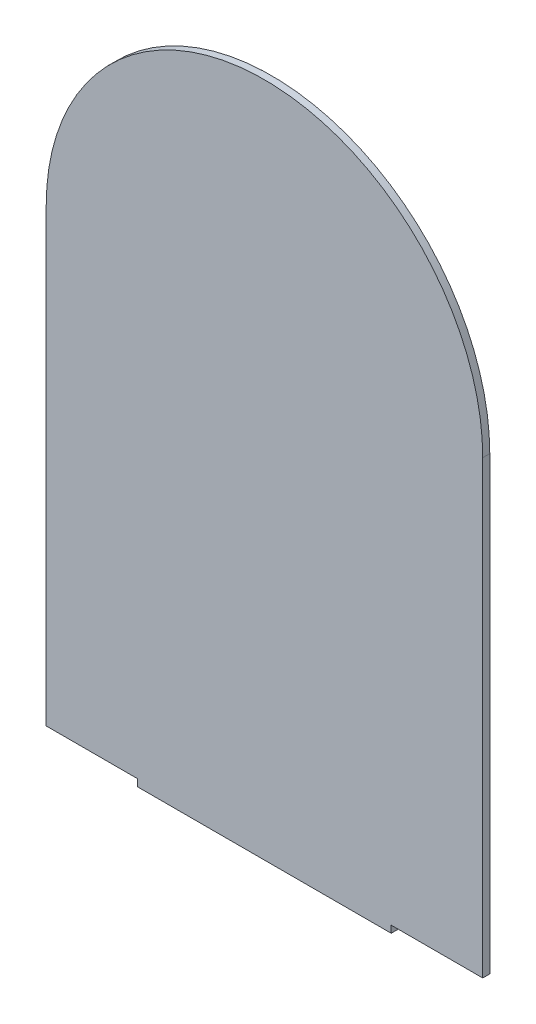
ISO-10303-21;
HEADER;
FILE_DESCRIPTION(('STEP AP214'),'2;1');
FILE_NAME('part.step','',(''),(''),'','','');
FILE_SCHEMA(('AUTOMOTIVE_DESIGN { 1 0 10303 214 1 1 1 1 }'));
ENDSEC;
DATA;
#1=APPLICATION_CONTEXT('core data for automotive mechanical design processes');
#2=APPLICATION_PROTOCOL_DEFINITION('international standard','automotive_design',2000,#1);
#3=PRODUCT_CONTEXT('',#1,'mechanical');
#4=PRODUCT('Part','Part','',(#3));
#5=PRODUCT_RELATED_PRODUCT_CATEGORY('part','',(#4));
#6=PRODUCT_DEFINITION_FORMATION('','',#4);
#7=PRODUCT_DEFINITION_CONTEXT('part definition',#1,'design');
#8=PRODUCT_DEFINITION('design','',#6,#7);
#9=PRODUCT_DEFINITION_SHAPE('','',#8);
#10=(LENGTH_UNIT() NAMED_UNIT(*) SI_UNIT(.MILLI.,.METRE.));
#11=(NAMED_UNIT(*) PLANE_ANGLE_UNIT() SI_UNIT($,.RADIAN.));
#12=(NAMED_UNIT(*) SI_UNIT($,.STERADIAN.) SOLID_ANGLE_UNIT());
#13=UNCERTAINTY_MEASURE_WITH_UNIT(LENGTH_MEASURE(1.E-05),#10,'distance_accuracy_value','');
#14=(GEOMETRIC_REPRESENTATION_CONTEXT(3) GLOBAL_UNCERTAINTY_ASSIGNED_CONTEXT((#13)) GLOBAL_UNIT_ASSIGNED_CONTEXT((#10,
#11,#12)) REPRESENTATION_CONTEXT('',''));
#15=CARTESIAN_POINT('',(0.,0.,0.));
#16=DIRECTION('',(0.,0.,1.));
#17=DIRECTION('',(1.,0.,0.));
#18=AXIS2_PLACEMENT_3D('',#15,#16,#17);
#19=CARTESIAN_POINT('',(98.425,203.2,3.175));
#20=DIRECTION('',(0.,0.,-1.));
#21=DIRECTION('',(-1.,0.,0.));
#22=AXIS2_PLACEMENT_3D('',#19,#20,#21);
#23=CYLINDRICAL_SURFACE('',#22,98.425);
#24=CARTESIAN_POINT('',(98.425,203.2,0.));
#25=DIRECTION('',(0.,0.,1.));
#26=DIRECTION('',(-1.,0.,0.));
#27=AXIS2_PLACEMENT_3D('',#24,#25,#26);
#28=CIRCLE('',#27,98.425);
#29=CARTESIAN_POINT('',(196.85,203.2,0.));
#30=VERTEX_POINT('',#29);
#31=CARTESIAN_POINT('',(0.,203.2,0.));
#32=VERTEX_POINT('',#31);
#33=EDGE_CURVE('E131',#30,#32,#28,.T.);
#34=ORIENTED_EDGE('',*,*,#33,.T.);
#35=DIRECTION('',(0.,0.,-1.));
#36=VECTOR('',#35,1.);
#37=CARTESIAN_POINT('',(0.,203.2,3.175));
#38=LINE('',#37,#36);
#39=CARTESIAN_POINT('',(0.,203.2,3.175));
#40=VERTEX_POINT('',#39);
#41=EDGE_CURVE('E11',#40,#32,#38,.T.);
#42=ORIENTED_EDGE('',*,*,#41,.F.);
#43=CARTESIAN_POINT('',(98.425,203.2,3.175));
#44=DIRECTION('',(0.,0.,1.));
#45=DIRECTION('',(-1.,0.,0.));
#46=AXIS2_PLACEMENT_3D('',#43,#44,#45);
#47=CIRCLE('',#46,98.425);
#48=CARTESIAN_POINT('',(196.85,203.2,3.175));
#49=VERTEX_POINT('',#48);
#50=EDGE_CURVE('E145',#49,#40,#47,.T.);
#51=ORIENTED_EDGE('',*,*,#50,.F.);
#52=DIRECTION('',(0.,0.,-1.));
#53=VECTOR('',#52,1.);
#54=CARTESIAN_POINT('',(196.85,203.2,3.175));
#55=LINE('',#54,#53);
#56=EDGE_CURVE('E127',#49,#30,#55,.T.);
#57=ORIENTED_EDGE('',*,*,#56,.T.);
#58=EDGE_LOOP('',(#34,#42,#51,#57));
#59=FACE_BOUND('',#58,.T.);
#60=ADVANCED_FACE('F35',(#59),#23,.T.);
#61=CARTESIAN_POINT('',(0.,203.2,3.175));
#62=DIRECTION('',(1.,0.,0.));
#63=DIRECTION('',(0.,1.,0.));
#64=AXIS2_PLACEMENT_3D('',#61,#62,#63);
#65=PLANE('',#64);
#66=DIRECTION('',(0.,-1.,0.));
#67=VECTOR('',#66,1.);
#68=CARTESIAN_POINT('',(0.,203.2,0.));
#69=LINE('',#68,#67);
#70=CARTESIAN_POINT('',(0.,0.,0.));
#71=VERTEX_POINT('',#70);
#72=EDGE_CURVE('E134',#32,#71,#69,.T.);
#73=ORIENTED_EDGE('',*,*,#72,.T.);
#74=DIRECTION('',(0.,0.,-1.));
#75=VECTOR('',#74,1.);
#76=CARTESIAN_POINT('',(0.,0.,3.175));
#77=LINE('',#76,#75);
#78=CARTESIAN_POINT('',(0.,0.,3.175));
#79=VERTEX_POINT('',#78);
#80=EDGE_CURVE('E43',#79,#71,#77,.T.);
#81=ORIENTED_EDGE('',*,*,#80,.F.);
#82=DIRECTION('',(0.,-1.,0.));
#83=VECTOR('',#82,1.);
#84=CARTESIAN_POINT('',(0.,203.2,3.175));
#85=LINE('',#84,#83);
#86=EDGE_CURVE('E94',#40,#79,#85,.T.);
#87=ORIENTED_EDGE('',*,*,#86,.F.);
#88=ORIENTED_EDGE('',*,*,#41,.T.);
#89=EDGE_LOOP('',(#73,#81,#87,#88));
#90=FACE_BOUND('',#89,.T.);
#91=ADVANCED_FACE('F180',(#90),#65,.F.);
#92=CARTESIAN_POINT('',(0.,0.,3.175));
#93=DIRECTION('',(0.,1.,0.));
#94=DIRECTION('',(0.,0.,1.));
#95=AXIS2_PLACEMENT_3D('',#92,#93,#94);
#96=PLANE('',#95);
#97=DIRECTION('',(1.,0.,0.));
#98=VECTOR('',#97,1.);
#99=CARTESIAN_POINT('',(0.,0.,0.));
#100=LINE('',#99,#98);
#101=CARTESIAN_POINT('',(41.275,0.,0.));
#102=VERTEX_POINT('',#101);
#103=EDGE_CURVE('E136',#71,#102,#100,.T.);
#104=ORIENTED_EDGE('',*,*,#103,.T.);
#105=DIRECTION('',(0.,0.,-1.));
#106=VECTOR('',#105,1.);
#107=CARTESIAN_POINT('',(41.275,0.,3.175));
#108=LINE('',#107,#106);
#109=CARTESIAN_POINT('',(41.275,0.,3.175));
#110=VERTEX_POINT('',#109);
#111=EDGE_CURVE('E152',#110,#102,#108,.T.);
#112=ORIENTED_EDGE('',*,*,#111,.F.);
#113=DIRECTION('',(1.,0.,0.));
#114=VECTOR('',#113,1.);
#115=CARTESIAN_POINT('',(0.,0.,3.175));
#116=LINE('',#115,#114);
#117=EDGE_CURVE('E160',#79,#110,#116,.T.);
#118=ORIENTED_EDGE('',*,*,#117,.F.);
#119=ORIENTED_EDGE('',*,*,#80,.T.);
#120=EDGE_LOOP('',(#104,#112,#118,#119));
#121=FACE_BOUND('',#120,.T.);
#122=ADVANCED_FACE('F158',(#121),#96,.F.);
#123=CARTESIAN_POINT('',(41.275,0.,3.175));
#124=DIRECTION('',(1.,0.,0.));
#125=DIRECTION('',(0.,0.,-1.));
#126=AXIS2_PLACEMENT_3D('',#123,#124,#125);
#127=PLANE('',#126);
#128=DIRECTION('',(0.,-1.,0.));
#129=VECTOR('',#128,1.);
#130=CARTESIAN_POINT('',(41.275,0.,0.));
#131=LINE('',#130,#129);
#132=CARTESIAN_POINT('',(41.275,-3.175,0.));
#133=VERTEX_POINT('',#132);
#134=EDGE_CURVE('E138',#102,#133,#131,.T.);
#135=ORIENTED_EDGE('',*,*,#134,.T.);
#136=DIRECTION('',(0.,0.,-1.));
#137=VECTOR('',#136,1.);
#138=CARTESIAN_POINT('',(41.275,-3.175,3.175));
#139=LINE('',#138,#137);
#140=CARTESIAN_POINT('',(41.275,-3.175,3.175));
#141=VERTEX_POINT('',#140);
#142=EDGE_CURVE('E149',#141,#133,#139,.T.);
#143=ORIENTED_EDGE('',*,*,#142,.F.);
#144=DIRECTION('',(0.,-1.,0.));
#145=VECTOR('',#144,1.);
#146=CARTESIAN_POINT('',(41.275,0.,3.175));
#147=LINE('',#146,#145);
#148=EDGE_CURVE('E172',#110,#141,#147,.T.);
#149=ORIENTED_EDGE('',*,*,#148,.F.);
#150=ORIENTED_EDGE('',*,*,#111,.T.);
#151=EDGE_LOOP('',(#135,#143,#149,#150));
#152=FACE_BOUND('',#151,.T.);
#153=ADVANCED_FACE('F168',(#152),#127,.F.);
#154=CARTESIAN_POINT('',(41.275,-3.175,3.175));
#155=DIRECTION('',(0.,1.,0.));
#156=DIRECTION('',(0.,0.,1.));
#157=AXIS2_PLACEMENT_3D('',#154,#155,#156);
#158=PLANE('',#157);
#159=DIRECTION('',(1.,0.,0.));
#160=VECTOR('',#159,1.);
#161=CARTESIAN_POINT('',(41.275,-3.175,0.));
#162=LINE('',#161,#160);
#163=CARTESIAN_POINT('',(155.575,-3.175,0.));
#164=VERTEX_POINT('',#163);
#165=EDGE_CURVE('E140',#133,#164,#162,.T.);
#166=ORIENTED_EDGE('',*,*,#165,.T.);
#167=DIRECTION('',(0.,0.,-1.));
#168=VECTOR('',#167,1.);
#169=CARTESIAN_POINT('',(155.575,-3.175,3.175));
#170=LINE('',#169,#168);
#171=CARTESIAN_POINT('',(155.575,-3.175,3.175));
#172=VERTEX_POINT('',#171);
#173=EDGE_CURVE('E122',#172,#164,#170,.T.);
#174=ORIENTED_EDGE('',*,*,#173,.F.);
#175=DIRECTION('',(1.,0.,0.));
#176=VECTOR('',#175,1.);
#177=CARTESIAN_POINT('',(41.275,-3.175,3.175));
#178=LINE('',#177,#176);
#179=EDGE_CURVE('E113',#141,#172,#178,.T.);
#180=ORIENTED_EDGE('',*,*,#179,.F.);
#181=ORIENTED_EDGE('',*,*,#142,.T.);
#182=EDGE_LOOP('',(#166,#174,#180,#181));
#183=FACE_BOUND('',#182,.T.);
#184=ADVANCED_FACE('F171',(#183),#158,.F.);
#185=CARTESIAN_POINT('',(155.575,0.,3.175));
#186=DIRECTION('',(-1.,0.,0.));
#187=DIRECTION('',(0.,-1.,0.));
#188=AXIS2_PLACEMENT_3D('',#185,#186,#187);
#189=PLANE('',#188);
#190=DIRECTION('',(0.,1.,0.));
#191=VECTOR('',#190,1.);
#192=CARTESIAN_POINT('',(155.575,0.,0.));
#193=LINE('',#192,#191);
#194=CARTESIAN_POINT('',(155.575,0.,0.));
#195=VERTEX_POINT('',#194);
#196=EDGE_CURVE('E121',#164,#195,#193,.T.);
#197=ORIENTED_EDGE('',*,*,#196,.T.);
#198=DIRECTION('',(0.,0.,-1.));
#199=VECTOR('',#198,1.);
#200=CARTESIAN_POINT('',(155.575,0.,3.175));
#201=LINE('',#200,#199);
#202=CARTESIAN_POINT('',(155.575,0.,3.175));
#203=VERTEX_POINT('',#202);
#204=EDGE_CURVE('E118',#203,#195,#201,.T.);
#205=ORIENTED_EDGE('',*,*,#204,.F.);
#206=DIRECTION('',(0.,1.,0.));
#207=VECTOR('',#206,1.);
#208=CARTESIAN_POINT('',(155.575,0.,3.175));
#209=LINE('',#208,#207);
#210=EDGE_CURVE('E107',#172,#203,#209,.T.);
#211=ORIENTED_EDGE('',*,*,#210,.F.);
#212=ORIENTED_EDGE('',*,*,#173,.T.);
#213=EDGE_LOOP('',(#197,#205,#211,#212));
#214=FACE_BOUND('',#213,.T.);
#215=ADVANCED_FACE('F119',(#214),#189,.F.);
#216=CARTESIAN_POINT('',(155.575,0.,3.175));
#217=DIRECTION('',(0.,1.,0.));
#218=DIRECTION('',(0.,0.,1.));
#219=AXIS2_PLACEMENT_3D('',#216,#217,#218);
#220=PLANE('',#219);
#221=DIRECTION('',(1.,0.,0.));
#222=VECTOR('',#221,1.);
#223=CARTESIAN_POINT('',(155.575,0.,0.));
#224=LINE('',#223,#222);
#225=CARTESIAN_POINT('',(196.85,0.,0.));
#226=VERTEX_POINT('',#225);
#227=EDGE_CURVE('E80',#195,#226,#224,.T.);
#228=ORIENTED_EDGE('',*,*,#227,.T.);
#229=DIRECTION('',(0.,0.,-1.));
#230=VECTOR('',#229,1.);
#231=CARTESIAN_POINT('',(196.85,0.,3.175));
#232=LINE('',#231,#230);
#233=CARTESIAN_POINT('',(196.85,0.,3.175));
#234=VERTEX_POINT('',#233);
#235=EDGE_CURVE('E123',#234,#226,#232,.T.);
#236=ORIENTED_EDGE('',*,*,#235,.F.);
#237=DIRECTION('',(1.,0.,0.));
#238=VECTOR('',#237,1.);
#239=CARTESIAN_POINT('',(155.575,0.,3.175));
#240=LINE('',#239,#238);
#241=EDGE_CURVE('E111',#203,#234,#240,.T.);
#242=ORIENTED_EDGE('',*,*,#241,.F.);
#243=ORIENTED_EDGE('',*,*,#204,.T.);
#244=EDGE_LOOP('',(#228,#236,#242,#243));
#245=FACE_BOUND('',#244,.T.);
#246=ADVANCED_FACE('F125',(#245),#220,.F.);
#247=CARTESIAN_POINT('',(196.85,0.,3.175));
#248=DIRECTION('',(-1.,0.,0.));
#249=DIRECTION('',(0.,-1.,0.));
#250=AXIS2_PLACEMENT_3D('',#247,#248,#249);
#251=PLANE('',#250);
#252=DIRECTION('',(0.,1.,0.));
#253=VECTOR('',#252,1.);
#254=CARTESIAN_POINT('',(196.85,0.,0.));
#255=LINE('',#254,#253);
#256=EDGE_CURVE('E86',#226,#30,#255,.T.);
#257=ORIENTED_EDGE('',*,*,#256,.T.);
#258=ORIENTED_EDGE('',*,*,#56,.F.);
#259=DIRECTION('',(0.,1.,0.));
#260=VECTOR('',#259,1.);
#261=CARTESIAN_POINT('',(196.85,0.,3.175));
#262=LINE('',#261,#260);
#263=EDGE_CURVE('E51',#234,#49,#262,.T.);
#264=ORIENTED_EDGE('',*,*,#263,.F.);
#265=ORIENTED_EDGE('',*,*,#235,.T.);
#266=EDGE_LOOP('',(#257,#258,#264,#265));
#267=FACE_BOUND('',#266,.T.);
#268=ADVANCED_FACE('F196',(#267),#251,.F.);
#269=CARTESIAN_POINT('',(98.425,203.2,3.175));
#270=DIRECTION('',(0.,0.,-1.));
#271=DIRECTION('',(-1.,0.,0.));
#272=AXIS2_PLACEMENT_3D('',#269,#270,#271);
#273=PLANE('',#272);
#274=ORIENTED_EDGE('',*,*,#50,.T.);
#275=ORIENTED_EDGE('',*,*,#86,.T.);
#276=ORIENTED_EDGE('',*,*,#117,.T.);
#277=ORIENTED_EDGE('',*,*,#148,.T.);
#278=ORIENTED_EDGE('',*,*,#179,.T.);
#279=ORIENTED_EDGE('',*,*,#210,.T.);
#280=ORIENTED_EDGE('',*,*,#241,.T.);
#281=ORIENTED_EDGE('',*,*,#263,.T.);
#282=EDGE_LOOP('',(#274,#275,#276,#277,#278,#279,#280,#281));
#283=FACE_BOUND('',#282,.T.);
#284=ADVANCED_FACE('F109',(#283),#273,.F.);
#285=CARTESIAN_POINT('',(98.425,203.2,0.));
#286=DIRECTION('',(0.,0.,-1.));
#287=DIRECTION('',(-1.,0.,0.));
#288=AXIS2_PLACEMENT_3D('',#285,#286,#287);
#289=PLANE('',#288);
#290=ORIENTED_EDGE('',*,*,#33,.F.);
#291=ORIENTED_EDGE('',*,*,#256,.F.);
#292=ORIENTED_EDGE('',*,*,#227,.F.);
#293=ORIENTED_EDGE('',*,*,#196,.F.);
#294=ORIENTED_EDGE('',*,*,#165,.F.);
#295=ORIENTED_EDGE('',*,*,#134,.F.);
#296=ORIENTED_EDGE('',*,*,#103,.F.);
#297=ORIENTED_EDGE('',*,*,#72,.F.);
#298=EDGE_LOOP('',(#290,#291,#292,#293,#294,#295,#296,#297));
#299=FACE_BOUND('',#298,.T.);
#300=ADVANCED_FACE('F164',(#299),#289,.T.);
#301=CLOSED_SHELL('',(#60,#91,#122,#153,#184,#215,#246,#268,#284,#300));
#302=MANIFOLD_SOLID_BREP('B2',#301);
#303=ADVANCED_BREP_SHAPE_REPRESENTATION('',(#18,#302),#14);
#304=SHAPE_DEFINITION_REPRESENTATION(#9,#303);
ENDSEC;
END-ISO-10303-21;
